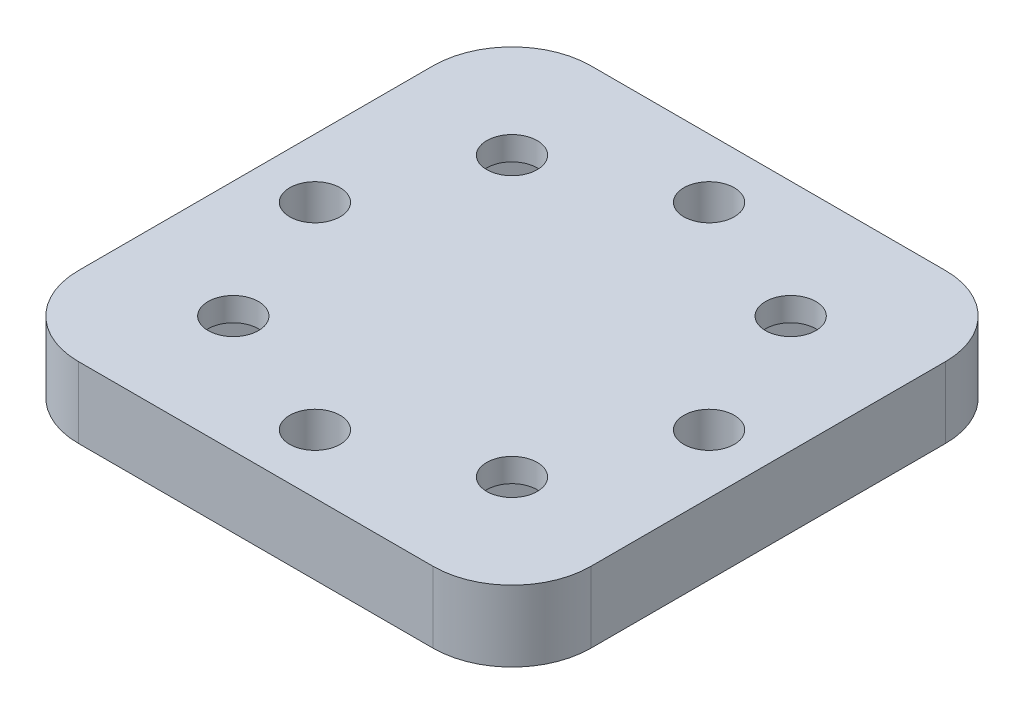
ISO-10303-21;
HEADER;
FILE_DESCRIPTION(('STEP AP214'),'2;1');
FILE_NAME('part.step','',(''),(''),'','','');
FILE_SCHEMA(('AUTOMOTIVE_DESIGN { 1 0 10303 214 1 1 1 1 }'));
ENDSEC;
DATA;
#1=APPLICATION_CONTEXT('core data for automotive mechanical design processes');
#2=APPLICATION_PROTOCOL_DEFINITION('international standard','automotive_design',2000,#1);
#3=PRODUCT_CONTEXT('',#1,'mechanical');
#4=PRODUCT('Part','Part','',(#3));
#5=PRODUCT_RELATED_PRODUCT_CATEGORY('part','',(#4));
#6=PRODUCT_DEFINITION_FORMATION('','',#4);
#7=PRODUCT_DEFINITION_CONTEXT('part definition',#1,'design');
#8=PRODUCT_DEFINITION('design','',#6,#7);
#9=PRODUCT_DEFINITION_SHAPE('','',#8);
#10=(LENGTH_UNIT() NAMED_UNIT(*) SI_UNIT(.MILLI.,.METRE.));
#11=(NAMED_UNIT(*) PLANE_ANGLE_UNIT() SI_UNIT($,.RADIAN.));
#12=(NAMED_UNIT(*) SI_UNIT($,.STERADIAN.) SOLID_ANGLE_UNIT());
#13=UNCERTAINTY_MEASURE_WITH_UNIT(LENGTH_MEASURE(1.E-05),#10,'distance_accuracy_value','');
#14=(GEOMETRIC_REPRESENTATION_CONTEXT(3) GLOBAL_UNCERTAINTY_ASSIGNED_CONTEXT((#13)) GLOBAL_UNIT_ASSIGNED_CONTEXT((#10,
#11,#12)) REPRESENTATION_CONTEXT('',''));
#15=CARTESIAN_POINT('',(0.,0.,0.));
#16=DIRECTION('',(0.,0.,1.));
#17=DIRECTION('',(1.,0.,0.));
#18=AXIS2_PLACEMENT_3D('',#15,#16,#17);
#19=CARTESIAN_POINT('',(-32.5,9.,-32.5));
#20=DIRECTION('',(1.,0.,0.));
#21=DIRECTION('',(0.,0.,-1.));
#22=AXIS2_PLACEMENT_3D('',#19,#20,#21);
#23=PLANE('',#22);
#24=DIRECTION('',(0.,0.,1.));
#25=VECTOR('',#24,1.);
#26=CARTESIAN_POINT('',(-32.5,0.,-32.5));
#27=LINE('',#26,#25);
#28=CARTESIAN_POINT('',(-32.5,0.,-22.5));
#29=VERTEX_POINT('',#28);
#30=CARTESIAN_POINT('',(-32.5,0.,22.5));
#31=VERTEX_POINT('',#30);
#32=EDGE_CURVE('E371',#29,#31,#27,.T.);
#33=ORIENTED_EDGE('',*,*,#32,.T.);
#34=DIRECTION('',(0.,-1.,0.));
#35=VECTOR('',#34,1.);
#36=CARTESIAN_POINT('',(-32.5,9.,22.5));
#37=LINE('',#36,#35);
#38=CARTESIAN_POINT('',(-32.5,9.,22.5));
#39=VERTEX_POINT('',#38);
#40=EDGE_CURVE('E429',#31,#39,#37,.F.);
#41=ORIENTED_EDGE('',*,*,#40,.T.);
#42=DIRECTION('',(0.,0.,1.));
#43=VECTOR('',#42,1.);
#44=CARTESIAN_POINT('',(-32.5,9.,-32.5));
#45=LINE('',#44,#43);
#46=CARTESIAN_POINT('',(-32.5,9.,-22.5));
#47=VERTEX_POINT('',#46);
#48=EDGE_CURVE('E372',#47,#39,#45,.T.);
#49=ORIENTED_EDGE('',*,*,#48,.F.);
#50=DIRECTION('',(0.,-1.,0.));
#51=VECTOR('',#50,1.);
#52=CARTESIAN_POINT('',(-32.5,9.,-22.5));
#53=LINE('',#52,#51);
#54=EDGE_CURVE('E426',#47,#29,#53,.T.);
#55=ORIENTED_EDGE('',*,*,#54,.T.);
#56=EDGE_LOOP('',(#33,#41,#49,#55));
#57=FACE_BOUND('',#56,.T.);
#58=ADVANCED_FACE('F35',(#57),#23,.F.);
#59=CARTESIAN_POINT('',(-32.5,9.,32.5));
#60=DIRECTION('',(0.,0.,-1.));
#61=DIRECTION('',(-1.,0.,0.));
#62=AXIS2_PLACEMENT_3D('',#59,#60,#61);
#63=PLANE('',#62);
#64=DIRECTION('',(1.,0.,0.));
#65=VECTOR('',#64,1.);
#66=CARTESIAN_POINT('',(-32.5,0.,32.5));
#67=LINE('',#66,#65);
#68=CARTESIAN_POINT('',(-22.5,0.,32.5));
#69=VERTEX_POINT('',#68);
#70=CARTESIAN_POINT('',(22.5,0.,32.5));
#71=VERTEX_POINT('',#70);
#72=EDGE_CURVE('E386',#69,#71,#67,.T.);
#73=ORIENTED_EDGE('',*,*,#72,.T.);
#74=DIRECTION('',(0.,-1.,0.));
#75=VECTOR('',#74,1.);
#76=CARTESIAN_POINT('',(22.5,9.,32.5));
#77=LINE('',#76,#75);
#78=CARTESIAN_POINT('',(22.5,9.,32.5));
#79=VERTEX_POINT('',#78);
#80=EDGE_CURVE('E417',#71,#79,#77,.F.);
#81=ORIENTED_EDGE('',*,*,#80,.T.);
#82=DIRECTION('',(1.,0.,0.));
#83=VECTOR('',#82,1.);
#84=CARTESIAN_POINT('',(-32.5,9.,32.5));
#85=LINE('',#84,#83);
#86=CARTESIAN_POINT('',(-22.5,9.,32.5));
#87=VERTEX_POINT('',#86);
#88=EDGE_CURVE('E375',#87,#79,#85,.T.);
#89=ORIENTED_EDGE('',*,*,#88,.F.);
#90=DIRECTION('',(0.,-1.,0.));
#91=VECTOR('',#90,1.);
#92=CARTESIAN_POINT('',(-22.5,9.,32.5));
#93=LINE('',#92,#91);
#94=EDGE_CURVE('E414',#87,#69,#93,.T.);
#95=ORIENTED_EDGE('',*,*,#94,.T.);
#96=EDGE_LOOP('',(#73,#81,#89,#95));
#97=FACE_BOUND('',#96,.T.);
#98=ADVANCED_FACE('F454',(#97),#63,.F.);
#99=CARTESIAN_POINT('',(32.5,9.,-32.5));
#100=DIRECTION('',(-1.,0.,0.));
#101=DIRECTION('',(0.,0.,1.));
#102=AXIS2_PLACEMENT_3D('',#99,#100,#101);
#103=PLANE('',#102);
#104=DIRECTION('',(0.,0.,-1.));
#105=VECTOR('',#104,1.);
#106=CARTESIAN_POINT('',(32.5,9.,-32.5));
#107=LINE('',#106,#105);
#108=CARTESIAN_POINT('',(32.5,9.,22.5));
#109=VERTEX_POINT('',#108);
#110=CARTESIAN_POINT('',(32.5,9.,-22.5));
#111=VERTEX_POINT('',#110);
#112=EDGE_CURVE('E379',#109,#111,#107,.T.);
#113=ORIENTED_EDGE('',*,*,#112,.F.);
#114=DIRECTION('',(0.,-1.,0.));
#115=VECTOR('',#114,1.);
#116=CARTESIAN_POINT('',(32.5,9.,22.5));
#117=LINE('',#116,#115);
#118=CARTESIAN_POINT('',(32.5,0.,22.5));
#119=VERTEX_POINT('',#118);
#120=EDGE_CURVE('E403',#109,#119,#117,.T.);
#121=ORIENTED_EDGE('',*,*,#120,.T.);
#122=DIRECTION('',(0.,0.,-1.));
#123=VECTOR('',#122,1.);
#124=CARTESIAN_POINT('',(32.5,0.,-32.5));
#125=LINE('',#124,#123);
#126=CARTESIAN_POINT('',(32.5,0.,-22.5));
#127=VERTEX_POINT('',#126);
#128=EDGE_CURVE('E389',#119,#127,#125,.T.);
#129=ORIENTED_EDGE('',*,*,#128,.T.);
#130=DIRECTION('',(0.,-1.,0.));
#131=VECTOR('',#130,1.);
#132=CARTESIAN_POINT('',(32.5,9.,-22.5));
#133=LINE('',#132,#131);
#134=EDGE_CURVE('E383',#127,#111,#133,.F.);
#135=ORIENTED_EDGE('',*,*,#134,.T.);
#136=EDGE_LOOP('',(#113,#121,#129,#135));
#137=FACE_BOUND('',#136,.T.);
#138=ADVANCED_FACE('F462',(#137),#103,.F.);
#139=CARTESIAN_POINT('',(-32.5,9.,-32.5));
#140=DIRECTION('',(0.,0.,1.));
#141=DIRECTION('',(1.,0.,0.));
#142=AXIS2_PLACEMENT_3D('',#139,#140,#141);
#143=PLANE('',#142);
#144=DIRECTION('',(-1.,0.,0.));
#145=VECTOR('',#144,1.);
#146=CARTESIAN_POINT('',(-32.5,0.,-32.5));
#147=LINE('',#146,#145);
#148=CARTESIAN_POINT('',(22.5,0.,-32.5));
#149=VERTEX_POINT('',#148);
#150=CARTESIAN_POINT('',(-22.5,0.,-32.5));
#151=VERTEX_POINT('',#150);
#152=EDGE_CURVE('E376',#149,#151,#147,.T.);
#153=ORIENTED_EDGE('',*,*,#152,.T.);
#154=DIRECTION('',(0.,-1.,0.));
#155=VECTOR('',#154,1.);
#156=CARTESIAN_POINT('',(-22.5,9.,-32.5));
#157=LINE('',#156,#155);
#158=CARTESIAN_POINT('',(-22.5,9.,-32.5));
#159=VERTEX_POINT('',#158);
#160=EDGE_CURVE('E12',#151,#159,#157,.F.);
#161=ORIENTED_EDGE('',*,*,#160,.T.);
#162=DIRECTION('',(-1.,0.,0.));
#163=VECTOR('',#162,1.);
#164=CARTESIAN_POINT('',(-32.5,9.,-32.5));
#165=LINE('',#164,#163);
#166=CARTESIAN_POINT('',(22.5,9.,-32.5));
#167=VERTEX_POINT('',#166);
#168=EDGE_CURVE('E381',#167,#159,#165,.T.);
#169=ORIENTED_EDGE('',*,*,#168,.F.);
#170=DIRECTION('',(0.,-1.,0.));
#171=VECTOR('',#170,1.);
#172=CARTESIAN_POINT('',(22.5,9.,-32.5));
#173=LINE('',#172,#171);
#174=EDGE_CURVE('E43',#167,#149,#173,.T.);
#175=ORIENTED_EDGE('',*,*,#174,.T.);
#176=EDGE_LOOP('',(#153,#161,#169,#175));
#177=FACE_BOUND('',#176,.T.);
#178=ADVANCED_FACE('F433',(#177),#143,.F.);
#179=CARTESIAN_POINT('',(0.,9.,0.));
#180=DIRECTION('',(0.,1.,0.));
#181=DIRECTION('',(0.,0.,1.));
#182=AXIS2_PLACEMENT_3D('',#179,#180,#181);
#183=PLANE('',#182);
#184=CARTESIAN_POINT('',(0.,9.,25.));
#185=DIRECTION('',(0.,1.,0.));
#186=DIRECTION('',(0.,0.,1.));
#187=AXIS2_PLACEMENT_3D('',#184,#185,#186);
#188=CIRCLE('',#187,3.2);
#189=CARTESIAN_POINT('',(0.,9.,28.2));
#190=VERTEX_POINT('',#189);
#191=EDGE_CURVE('E348',#190,#190,#188,.T.);
#192=ORIENTED_EDGE('',*,*,#191,.F.);
#193=EDGE_LOOP('',(#192));
#194=FACE_BOUND('',#193,.T.);
#195=CARTESIAN_POINT('',(-25.,9.,0.));
#196=DIRECTION('',(0.,1.,0.));
#197=DIRECTION('',(0.,0.,1.));
#198=AXIS2_PLACEMENT_3D('',#195,#196,#197);
#199=CIRCLE('',#198,3.2);
#200=CARTESIAN_POINT('',(-25.,9.,3.20000000000001));
#201=VERTEX_POINT('',#200);
#202=EDGE_CURVE('E342',#201,#201,#199,.T.);
#203=ORIENTED_EDGE('',*,*,#202,.F.);
#204=EDGE_LOOP('',(#203));
#205=FACE_BOUND('',#204,.T.);
#206=CARTESIAN_POINT('',(0.,9.,-25.));
#207=DIRECTION('',(0.,1.,0.));
#208=DIRECTION('',(0.,0.,1.));
#209=AXIS2_PLACEMENT_3D('',#206,#207,#208);
#210=CIRCLE('',#209,3.2);
#211=CARTESIAN_POINT('',(0.,9.,-21.8));
#212=VERTEX_POINT('',#211);
#213=EDGE_CURVE('E335',#212,#212,#210,.T.);
#214=ORIENTED_EDGE('',*,*,#213,.F.);
#215=EDGE_LOOP('',(#214));
#216=FACE_BOUND('',#215,.T.);
#217=CARTESIAN_POINT('',(25.,9.,0.));
#218=DIRECTION('',(0.,1.,0.));
#219=DIRECTION('',(0.,0.,1.));
#220=AXIS2_PLACEMENT_3D('',#217,#218,#219);
#221=CIRCLE('',#220,3.2);
#222=CARTESIAN_POINT('',(25.,9.,3.19999999999999));
#223=VERTEX_POINT('',#222);
#224=EDGE_CURVE('E343',#223,#223,#221,.T.);
#225=ORIENTED_EDGE('',*,*,#224,.F.);
#226=EDGE_LOOP('',(#225));
#227=FACE_BOUND('',#226,.T.);
#228=CARTESIAN_POINT('',(17.6776695296637,9.,17.6776695296636));
#229=DIRECTION('',(0.,1.,0.));
#230=DIRECTION('',(0.,0.,1.));
#231=AXIS2_PLACEMENT_3D('',#228,#229,#230);
#232=CIRCLE('',#231,3.2);
#233=CARTESIAN_POINT('',(17.6776695296637,9.,20.8776695296636));
#234=VERTEX_POINT('',#233);
#235=EDGE_CURVE('E363',#234,#234,#232,.T.);
#236=ORIENTED_EDGE('',*,*,#235,.F.);
#237=EDGE_LOOP('',(#236));
#238=FACE_BOUND('',#237,.T.);
#239=CARTESIAN_POINT('',(-17.6776695296637,9.,17.6776695296637));
#240=DIRECTION('',(0.,1.,0.));
#241=DIRECTION('',(0.,0.,1.));
#242=AXIS2_PLACEMENT_3D('',#239,#240,#241);
#243=CIRCLE('',#242,3.2);
#244=CARTESIAN_POINT('',(-17.6776695296637,9.,20.8776695296637));
#245=VERTEX_POINT('',#244);
#246=EDGE_CURVE('E360',#245,#245,#243,.T.);
#247=ORIENTED_EDGE('',*,*,#246,.F.);
#248=EDGE_LOOP('',(#247));
#249=FACE_BOUND('',#248,.T.);
#250=CARTESIAN_POINT('',(17.6776695296637,9.,-17.6776695296637));
#251=DIRECTION('',(0.,1.,0.));
#252=DIRECTION('',(0.,0.,1.));
#253=AXIS2_PLACEMENT_3D('',#250,#251,#252);
#254=CIRCLE('',#253,3.2);
#255=CARTESIAN_POINT('',(17.6776695296637,9.,-14.4776695296637));
#256=VERTEX_POINT('',#255);
#257=EDGE_CURVE('E355',#256,#256,#254,.T.);
#258=ORIENTED_EDGE('',*,*,#257,.F.);
#259=EDGE_LOOP('',(#258));
#260=FACE_BOUND('',#259,.T.);
#261=CARTESIAN_POINT('',(-17.6776695296637,9.,-17.6776695296636));
#262=DIRECTION('',(0.,1.,0.));
#263=DIRECTION('',(0.,0.,1.));
#264=AXIS2_PLACEMENT_3D('',#261,#262,#263);
#265=CIRCLE('',#264,3.2);
#266=CARTESIAN_POINT('',(-17.6776695296637,9.,-14.4776695296637));
#267=VERTEX_POINT('',#266);
#268=EDGE_CURVE('E368',#267,#267,#265,.T.);
#269=ORIENTED_EDGE('',*,*,#268,.F.);
#270=EDGE_LOOP('',(#269));
#271=FACE_BOUND('',#270,.T.);
#272=ORIENTED_EDGE('',*,*,#88,.T.);
#273=CARTESIAN_POINT('',(22.5,9.,22.5));
#274=DIRECTION('',(0.,1.,0.));
#275=DIRECTION('',(0.,0.,1.));
#276=AXIS2_PLACEMENT_3D('',#273,#274,#275);
#277=CIRCLE('',#276,10.);
#278=EDGE_CURVE('E424',#79,#109,#277,.T.);
#279=ORIENTED_EDGE('',*,*,#278,.T.);
#280=ORIENTED_EDGE('',*,*,#112,.T.);
#281=CARTESIAN_POINT('',(22.5,9.,-22.5));
#282=DIRECTION('',(0.,1.,0.));
#283=DIRECTION('',(0.,0.,1.));
#284=AXIS2_PLACEMENT_3D('',#281,#282,#283);
#285=CIRCLE('',#284,10.);
#286=EDGE_CURVE('E55',#111,#167,#285,.T.);
#287=ORIENTED_EDGE('',*,*,#286,.T.);
#288=ORIENTED_EDGE('',*,*,#168,.T.);
#289=CARTESIAN_POINT('',(-22.5,9.,-22.5));
#290=DIRECTION('',(0.,1.,0.));
#291=DIRECTION('',(0.,0.,1.));
#292=AXIS2_PLACEMENT_3D('',#289,#290,#291);
#293=CIRCLE('',#292,10.);
#294=EDGE_CURVE('E420',#159,#47,#293,.T.);
#295=ORIENTED_EDGE('',*,*,#294,.T.);
#296=ORIENTED_EDGE('',*,*,#48,.T.);
#297=CARTESIAN_POINT('',(-22.5,9.,22.5));
#298=DIRECTION('',(0.,1.,0.));
#299=DIRECTION('',(0.,0.,1.));
#300=AXIS2_PLACEMENT_3D('',#297,#298,#299);
#301=CIRCLE('',#300,10.);
#302=EDGE_CURVE('E422',#39,#87,#301,.T.);
#303=ORIENTED_EDGE('',*,*,#302,.T.);
#304=EDGE_LOOP('',(#272,#279,#280,#287,#288,#295,#296,#303));
#305=FACE_BOUND('',#304,.T.);
#306=ADVANCED_FACE('F447',(#194,#205,#216,#227,#238,#249,#260,#271,#305),#183,.T.);
#307=CARTESIAN_POINT('',(0.,0.,0.));
#308=DIRECTION('',(0.,1.,0.));
#309=DIRECTION('',(0.,0.,1.));
#310=AXIS2_PLACEMENT_3D('',#307,#308,#309);
#311=PLANE('',#310);
#312=DIRECTION('',(0.707106781186549,0.,0.707106781186546));
#313=VECTOR('',#312,1.);
#314=CARTESIAN_POINT('',(17.6776695296637,0.,10.3237590053236));
#315=LINE('',#314,#313);
#316=CARTESIAN_POINT('',(17.6776695296637,0.,10.3237590053236));
#317=VERTEX_POINT('',#316);
#318=CARTESIAN_POINT('',(25.0315800540038,0.,17.6776695296636));
#319=VERTEX_POINT('',#318);
#320=EDGE_CURVE('E221',#317,#319,#315,.T.);
#321=ORIENTED_EDGE('',*,*,#320,.F.);
#322=DIRECTION('',(0.707106781186552,0.,-0.707106781186543));
#323=VECTOR('',#322,1.);
#324=CARTESIAN_POINT('',(10.3237590053236,0.,17.6776695296636));
#325=LINE('',#324,#323);
#326=CARTESIAN_POINT('',(10.3237590053236,0.,17.6776695296636));
#327=VERTEX_POINT('',#326);
#328=EDGE_CURVE('E212',#327,#317,#325,.T.);
#329=ORIENTED_EDGE('',*,*,#328,.F.);
#330=DIRECTION('',(-0.707106781186549,0.,-0.707106781186546));
#331=VECTOR('',#330,1.);
#332=CARTESIAN_POINT('',(10.3237590053236,0.,17.6776695296636));
#333=LINE('',#332,#331);
#334=CARTESIAN_POINT('',(17.6776695296637,0.,25.0315800540037));
#335=VERTEX_POINT('',#334);
#336=EDGE_CURVE('E225',#335,#327,#333,.T.);
#337=ORIENTED_EDGE('',*,*,#336,.F.);
#338=DIRECTION('',(-0.707106781186546,0.,0.707106781186549));
#339=VECTOR('',#338,1.);
#340=CARTESIAN_POINT('',(17.6776695296637,0.,25.0315800540037));
#341=LINE('',#340,#339);
#342=EDGE_CURVE('E219',#319,#335,#341,.T.);
#343=ORIENTED_EDGE('',*,*,#342,.F.);
#344=EDGE_LOOP('',(#321,#329,#337,#343));
#345=FACE_BOUND('',#344,.T.);
#346=DIRECTION('',(0.707106781186547,0.,0.707106781186547));
#347=VECTOR('',#346,1.);
#348=CARTESIAN_POINT('',(17.6776695296637,0.,-25.0315800540038));
#349=LINE('',#348,#347);
#350=CARTESIAN_POINT('',(17.6776695296637,0.,-25.0315800540038));
#351=VERTEX_POINT('',#350);
#352=CARTESIAN_POINT('',(25.0315800540038,0.,-17.6776695296637));
#353=VERTEX_POINT('',#352);
#354=EDGE_CURVE('E240',#351,#353,#349,.T.);
#355=ORIENTED_EDGE('',*,*,#354,.F.);
#356=DIRECTION('',(0.707106781186544,0.,-0.707106781186551));
#357=VECTOR('',#356,1.);
#358=CARTESIAN_POINT('',(10.3237590053236,0.,-17.6776695296636));
#359=LINE('',#358,#357);
#360=CARTESIAN_POINT('',(10.3237590053236,0.,-17.6776695296636));
#361=VERTEX_POINT('',#360);
#362=EDGE_CURVE('E243',#361,#351,#359,.T.);
#363=ORIENTED_EDGE('',*,*,#362,.F.);
#364=DIRECTION('',(-0.707106781186546,0.,-0.707106781186549));
#365=VECTOR('',#364,1.);
#366=CARTESIAN_POINT('',(10.3237590053236,0.,-17.6776695296636));
#367=LINE('',#366,#365);
#368=CARTESIAN_POINT('',(17.6776695296637,0.,-10.3237590053236));
#369=VERTEX_POINT('',#368);
#370=EDGE_CURVE('E246',#369,#361,#367,.T.);
#371=ORIENTED_EDGE('',*,*,#370,.F.);
#372=DIRECTION('',(-0.707106781186547,0.,0.707106781186547));
#373=VECTOR('',#372,1.);
#374=CARTESIAN_POINT('',(17.6776695296637,0.,-10.3237590053236));
#375=LINE('',#374,#373);
#376=EDGE_CURVE('E237',#353,#369,#375,.T.);
#377=ORIENTED_EDGE('',*,*,#376,.F.);
#378=EDGE_LOOP('',(#355,#363,#371,#377));
#379=FACE_BOUND('',#378,.T.);
#380=DIRECTION('',(0.707106781186547,0.,0.707106781186548));
#381=VECTOR('',#380,1.);
#382=CARTESIAN_POINT('',(-17.6776695296637,0.,-25.0315800540038));
#383=LINE('',#382,#381);
#384=CARTESIAN_POINT('',(-17.6776695296637,0.,-25.0315800540038));
#385=VERTEX_POINT('',#384);
#386=CARTESIAN_POINT('',(-10.3237590053236,0.,-17.6776695296637));
#387=VERTEX_POINT('',#386);
#388=EDGE_CURVE('E273',#385,#387,#383,.T.);
#389=ORIENTED_EDGE('',*,*,#388,.F.);
#390=DIRECTION('',(0.707106781186553,0.,-0.707106781186542));
#391=VECTOR('',#390,1.);
#392=CARTESIAN_POINT('',(-25.0315800540038,0.,-17.6776695296638));
#393=LINE('',#392,#391);
#394=CARTESIAN_POINT('',(-25.0315800540038,0.,-17.6776695296638));
#395=VERTEX_POINT('',#394);
#396=EDGE_CURVE('E276',#395,#385,#393,.T.);
#397=ORIENTED_EDGE('',*,*,#396,.F.);
#398=DIRECTION('',(-0.707106781186547,0.,-0.707106781186547));
#399=VECTOR('',#398,1.);
#400=CARTESIAN_POINT('',(-25.0315800540038,0.,-17.6776695296638));
#401=LINE('',#400,#399);
#402=CARTESIAN_POINT('',(-17.6776695296637,0.,-10.3237590053236));
#403=VERTEX_POINT('',#402);
#404=EDGE_CURVE('E279',#403,#395,#401,.T.);
#405=ORIENTED_EDGE('',*,*,#404,.F.);
#406=DIRECTION('',(-0.707106781186547,0.,0.707106781186549));
#407=VECTOR('',#406,1.);
#408=CARTESIAN_POINT('',(-17.6776695296637,0.,-10.3237590053236));
#409=LINE('',#408,#407);
#410=EDGE_CURVE('E270',#387,#403,#409,.T.);
#411=ORIENTED_EDGE('',*,*,#410,.F.);
#412=EDGE_LOOP('',(#389,#397,#405,#411));
#413=FACE_BOUND('',#412,.T.);
#414=DIRECTION('',(0.707106781186546,0.,0.707106781186549));
#415=VECTOR('',#414,1.);
#416=CARTESIAN_POINT('',(-17.6776695296637,0.,10.3237590053236));
#417=LINE('',#416,#415);
#418=CARTESIAN_POINT('',(-17.6776695296637,0.,10.3237590053236));
#419=VERTEX_POINT('',#418);
#420=CARTESIAN_POINT('',(-10.3237590053236,0.,17.6776695296636));
#421=VERTEX_POINT('',#420);
#422=EDGE_CURVE('E304',#419,#421,#417,.T.);
#423=ORIENTED_EDGE('',*,*,#422,.F.);
#424=DIRECTION('',(0.707106781186549,0.,-0.707106781186546));
#425=VECTOR('',#424,1.);
#426=CARTESIAN_POINT('',(-25.0315800540038,0.,17.6776695296636));
#427=LINE('',#426,#425);
#428=CARTESIAN_POINT('',(-25.0315800540038,0.,17.6776695296636));
#429=VERTEX_POINT('',#428);
#430=EDGE_CURVE('E307',#429,#419,#427,.T.);
#431=ORIENTED_EDGE('',*,*,#430,.F.);
#432=DIRECTION('',(-0.707106781186546,0.,-0.707106781186549));
#433=VECTOR('',#432,1.);
#434=CARTESIAN_POINT('',(-25.0315800540038,0.,17.6776695296636));
#435=LINE('',#434,#433);
#436=CARTESIAN_POINT('',(-17.6776695296637,0.,25.0315800540038));
#437=VERTEX_POINT('',#436);
#438=EDGE_CURVE('E310',#437,#429,#435,.T.);
#439=ORIENTED_EDGE('',*,*,#438,.F.);
#440=DIRECTION('',(-0.707106781186543,0.,0.707106781186552));
#441=VECTOR('',#440,1.);
#442=CARTESIAN_POINT('',(-17.6776695296637,0.,25.0315800540038));
#443=LINE('',#442,#441);
#444=EDGE_CURVE('E301',#421,#437,#443,.T.);
#445=ORIENTED_EDGE('',*,*,#444,.F.);
#446=EDGE_LOOP('',(#423,#431,#439,#445));
#447=FACE_BOUND('',#446,.T.);
#448=CARTESIAN_POINT('',(0.,0.,25.));
#449=DIRECTION('',(0.,1.,0.));
#450=DIRECTION('',(0.,0.,1.));
#451=AXIS2_PLACEMENT_3D('',#448,#449,#450);
#452=CIRCLE('',#451,3.2);
#453=CARTESIAN_POINT('',(0.,0.,28.2));
#454=VERTEX_POINT('',#453);
#455=EDGE_CURVE('E351',#454,#454,#452,.F.);
#456=ORIENTED_EDGE('',*,*,#455,.F.);
#457=EDGE_LOOP('',(#456));
#458=FACE_BOUND('',#457,.T.);
#459=CARTESIAN_POINT('',(-25.,0.,0.));
#460=DIRECTION('',(0.,1.,0.));
#461=DIRECTION('',(0.,0.,1.));
#462=AXIS2_PLACEMENT_3D('',#459,#460,#461);
#463=CIRCLE('',#462,3.2);
#464=CARTESIAN_POINT('',(-25.,0.,3.20000000000001));
#465=VERTEX_POINT('',#464);
#466=EDGE_CURVE('E352',#465,#465,#463,.F.);
#467=ORIENTED_EDGE('',*,*,#466,.F.);
#468=EDGE_LOOP('',(#467));
#469=FACE_BOUND('',#468,.T.);
#470=CARTESIAN_POINT('',(0.,0.,-25.));
#471=DIRECTION('',(0.,1.,0.));
#472=DIRECTION('',(0.,0.,1.));
#473=AXIS2_PLACEMENT_3D('',#470,#471,#472);
#474=CIRCLE('',#473,3.2);
#475=CARTESIAN_POINT('',(0.,0.,-21.8));
#476=VERTEX_POINT('',#475);
#477=EDGE_CURVE('E338',#476,#476,#474,.F.);
#478=ORIENTED_EDGE('',*,*,#477,.F.);
#479=EDGE_LOOP('',(#478));
#480=FACE_BOUND('',#479,.T.);
#481=CARTESIAN_POINT('',(25.,0.,0.));
#482=DIRECTION('',(0.,1.,0.));
#483=DIRECTION('',(0.,0.,1.));
#484=AXIS2_PLACEMENT_3D('',#481,#482,#483);
#485=CIRCLE('',#484,3.2);
#486=CARTESIAN_POINT('',(25.,0.,3.19999999999999));
#487=VERTEX_POINT('',#486);
#488=EDGE_CURVE('E339',#487,#487,#485,.F.);
#489=ORIENTED_EDGE('',*,*,#488,.F.);
#490=EDGE_LOOP('',(#489));
#491=FACE_BOUND('',#490,.T.);
#492=ORIENTED_EDGE('',*,*,#128,.F.);
#493=CARTESIAN_POINT('',(22.5,0.,22.5));
#494=DIRECTION('',(0.,1.,0.));
#495=DIRECTION('',(0.,0.,1.));
#496=AXIS2_PLACEMENT_3D('',#493,#494,#495);
#497=CIRCLE('',#496,10.);
#498=EDGE_CURVE('E412',#119,#71,#497,.F.);
#499=ORIENTED_EDGE('',*,*,#498,.T.);
#500=ORIENTED_EDGE('',*,*,#72,.F.);
#501=CARTESIAN_POINT('',(-22.5,0.,22.5));
#502=DIRECTION('',(0.,1.,0.));
#503=DIRECTION('',(0.,0.,1.));
#504=AXIS2_PLACEMENT_3D('',#501,#502,#503);
#505=CIRCLE('',#504,10.);
#506=EDGE_CURVE('E410',#69,#31,#505,.F.);
#507=ORIENTED_EDGE('',*,*,#506,.T.);
#508=ORIENTED_EDGE('',*,*,#32,.F.);
#509=CARTESIAN_POINT('',(-22.5,0.,-22.5));
#510=DIRECTION('',(0.,1.,0.));
#511=DIRECTION('',(0.,0.,1.));
#512=AXIS2_PLACEMENT_3D('',#509,#510,#511);
#513=CIRCLE('',#512,10.);
#514=EDGE_CURVE('E408',#29,#151,#513,.F.);
#515=ORIENTED_EDGE('',*,*,#514,.T.);
#516=ORIENTED_EDGE('',*,*,#152,.F.);
#517=CARTESIAN_POINT('',(22.5,0.,-22.5));
#518=DIRECTION('',(0.,1.,0.));
#519=DIRECTION('',(0.,0.,1.));
#520=AXIS2_PLACEMENT_3D('',#517,#518,#519);
#521=CIRCLE('',#520,10.);
#522=EDGE_CURVE('E406',#149,#127,#521,.F.);
#523=ORIENTED_EDGE('',*,*,#522,.T.);
#524=EDGE_LOOP('',(#492,#499,#500,#507,#508,#515,#516,#523));
#525=FACE_BOUND('',#524,.T.);
#526=ADVANCED_FACE('F437',(#345,#379,#413,#447,#458,#469,#480,#491,#525),#311,.F.);
#527=CARTESIAN_POINT('',(-17.6776695296637,-9.05096679918782,-17.6776695296636));
#528=DIRECTION('',(0.,1.,0.));
#529=DIRECTION('',(0.,0.,1.));
#530=AXIS2_PLACEMENT_3D('',#527,#528,#529);
#531=CYLINDRICAL_SURFACE('',#530,3.2);
#532=CARTESIAN_POINT('',(-17.6776695296637,6.,-17.6776695296636));
#533=DIRECTION('',(0.,1.,0.));
#534=DIRECTION('',(0.,0.,1.));
#535=AXIS2_PLACEMENT_3D('',#532,#533,#534);
#536=CIRCLE('',#535,3.2);
#537=CARTESIAN_POINT('',(-17.6776695296637,6.,-14.4776695296637));
#538=VERTEX_POINT('',#537);
#539=EDGE_CURVE('E313',#538,#538,#536,.F.);
#540=ORIENTED_EDGE('',*,*,#539,.T.);
#541=EDGE_LOOP('',(#540));
#542=FACE_BOUND('',#541,.T.);
#543=ORIENTED_EDGE('',*,*,#268,.T.);
#544=EDGE_LOOP('',(#543));
#545=FACE_BOUND('',#544,.T.);
#546=ADVANCED_FACE('F738',(#542,#545),#531,.F.);
#547=CARTESIAN_POINT('',(17.6776695296637,-9.05096679918782,-17.6776695296637));
#548=DIRECTION('',(0.,1.,0.));
#549=DIRECTION('',(0.,0.,1.));
#550=AXIS2_PLACEMENT_3D('',#547,#548,#549);
#551=CYLINDRICAL_SURFACE('',#550,3.2);
#552=CARTESIAN_POINT('',(17.6776695296637,6.,-17.6776695296637));
#553=DIRECTION('',(0.,1.,0.));
#554=DIRECTION('',(0.,0.,1.));
#555=AXIS2_PLACEMENT_3D('',#552,#553,#554);
#556=CIRCLE('',#555,3.2);
#557=CARTESIAN_POINT('',(17.6776695296637,6.,-14.4776695296637));
#558=VERTEX_POINT('',#557);
#559=EDGE_CURVE('E397',#558,#558,#556,.F.);
#560=ORIENTED_EDGE('',*,*,#559,.T.);
#561=EDGE_LOOP('',(#560));
#562=FACE_BOUND('',#561,.T.);
#563=ORIENTED_EDGE('',*,*,#257,.T.);
#564=EDGE_LOOP('',(#563));
#565=FACE_BOUND('',#564,.T.);
#566=ADVANCED_FACE('F729',(#562,#565),#551,.F.);
#567=CARTESIAN_POINT('',(-17.6776695296637,-9.05096679918782,17.6776695296637));
#568=DIRECTION('',(0.,1.,0.));
#569=DIRECTION('',(0.,0.,1.));
#570=AXIS2_PLACEMENT_3D('',#567,#568,#569);
#571=CYLINDRICAL_SURFACE('',#570,3.2);
#572=CARTESIAN_POINT('',(-17.6776695296637,6.,17.6776695296637));
#573=DIRECTION('',(0.,1.,0.));
#574=DIRECTION('',(0.,0.,1.));
#575=AXIS2_PLACEMENT_3D('',#572,#573,#574);
#576=CIRCLE('',#575,3.2);
#577=CARTESIAN_POINT('',(-17.6776695296637,6.,20.8776695296637));
#578=VERTEX_POINT('',#577);
#579=EDGE_CURVE('E334',#578,#578,#576,.F.);
#580=ORIENTED_EDGE('',*,*,#579,.T.);
#581=EDGE_LOOP('',(#580));
#582=FACE_BOUND('',#581,.T.);
#583=ORIENTED_EDGE('',*,*,#246,.T.);
#584=EDGE_LOOP('',(#583));
#585=FACE_BOUND('',#584,.T.);
#586=ADVANCED_FACE('F720',(#582,#585),#571,.F.);
#587=CARTESIAN_POINT('',(17.6776695296637,-9.05096679918782,17.6776695296636));
#588=DIRECTION('',(0.,1.,0.));
#589=DIRECTION('',(0.,0.,1.));
#590=AXIS2_PLACEMENT_3D('',#587,#588,#589);
#591=CYLINDRICAL_SURFACE('',#590,3.2);
#592=CARTESIAN_POINT('',(17.6776695296637,6.,17.6776695296636));
#593=DIRECTION('',(0.,1.,0.));
#594=DIRECTION('',(0.,0.,1.));
#595=AXIS2_PLACEMENT_3D('',#592,#593,#594);
#596=CIRCLE('',#595,3.2);
#597=CARTESIAN_POINT('',(17.6776695296637,6.,20.8776695296636));
#598=VERTEX_POINT('',#597);
#599=EDGE_CURVE('E236',#598,#598,#596,.F.);
#600=ORIENTED_EDGE('',*,*,#599,.T.);
#601=EDGE_LOOP('',(#600));
#602=FACE_BOUND('',#601,.T.);
#603=ORIENTED_EDGE('',*,*,#235,.T.);
#604=EDGE_LOOP('',(#603));
#605=FACE_BOUND('',#604,.T.);
#606=ADVANCED_FACE('F712',(#602,#605),#591,.F.);
#607=CARTESIAN_POINT('',(25.,-9.05096679918782,0.));
#608=DIRECTION('',(0.,1.,0.));
#609=DIRECTION('',(0.,0.,1.));
#610=AXIS2_PLACEMENT_3D('',#607,#608,#609);
#611=CYLINDRICAL_SURFACE('',#610,3.2);
#612=ORIENTED_EDGE('',*,*,#488,.T.);
#613=EDGE_LOOP('',(#612));
#614=FACE_BOUND('',#613,.T.);
#615=ORIENTED_EDGE('',*,*,#224,.T.);
#616=EDGE_LOOP('',(#615));
#617=FACE_BOUND('',#616,.T.);
#618=ADVANCED_FACE('F703',(#614,#617),#611,.F.);
#619=CARTESIAN_POINT('',(0.,-9.05096679918782,-25.));
#620=DIRECTION('',(0.,1.,0.));
#621=DIRECTION('',(0.,0.,1.));
#622=AXIS2_PLACEMENT_3D('',#619,#620,#621);
#623=CYLINDRICAL_SURFACE('',#622,3.2);
#624=ORIENTED_EDGE('',*,*,#477,.T.);
#625=EDGE_LOOP('',(#624));
#626=FACE_BOUND('',#625,.T.);
#627=ORIENTED_EDGE('',*,*,#213,.T.);
#628=EDGE_LOOP('',(#627));
#629=FACE_BOUND('',#628,.T.);
#630=ADVANCED_FACE('F694',(#626,#629),#623,.F.);
#631=CARTESIAN_POINT('',(-25.,-9.05096679918782,0.));
#632=DIRECTION('',(0.,1.,0.));
#633=DIRECTION('',(0.,0.,1.));
#634=AXIS2_PLACEMENT_3D('',#631,#632,#633);
#635=CYLINDRICAL_SURFACE('',#634,3.2);
#636=ORIENTED_EDGE('',*,*,#466,.T.);
#637=EDGE_LOOP('',(#636));
#638=FACE_BOUND('',#637,.T.);
#639=ORIENTED_EDGE('',*,*,#202,.T.);
#640=EDGE_LOOP('',(#639));
#641=FACE_BOUND('',#640,.T.);
#642=ADVANCED_FACE('F684',(#638,#641),#635,.F.);
#643=CARTESIAN_POINT('',(0.,-9.05096679918782,25.));
#644=DIRECTION('',(0.,1.,0.));
#645=DIRECTION('',(0.,0.,1.));
#646=AXIS2_PLACEMENT_3D('',#643,#644,#645);
#647=CYLINDRICAL_SURFACE('',#646,3.2);
#648=ORIENTED_EDGE('',*,*,#455,.T.);
#649=EDGE_LOOP('',(#648));
#650=FACE_BOUND('',#649,.T.);
#651=ORIENTED_EDGE('',*,*,#191,.T.);
#652=EDGE_LOOP('',(#651));
#653=FACE_BOUND('',#652,.T.);
#654=ADVANCED_FACE('F674',(#650,#653),#647,.F.);
#655=CARTESIAN_POINT('',(0.,6.,0.));
#656=DIRECTION('',(0.,1.,0.));
#657=DIRECTION('',(0.,0.,1.));
#658=AXIS2_PLACEMENT_3D('',#655,#656,#657);
#659=PLANE('',#658);
#660=DIRECTION('',(-0.707106781186546,0.,-0.707106781186549));
#661=VECTOR('',#660,1.);
#662=CARTESIAN_POINT('',(-25.0315800540038,6.,17.6776695296636));
#663=LINE('',#662,#661);
#664=CARTESIAN_POINT('',(-17.6776695296637,6.,25.0315800540038));
#665=VERTEX_POINT('',#664);
#666=CARTESIAN_POINT('',(-25.0315800540038,6.,17.6776695296636));
#667=VERTEX_POINT('',#666);
#668=EDGE_CURVE('E317',#665,#667,#663,.T.);
#669=ORIENTED_EDGE('',*,*,#668,.T.);
#670=DIRECTION('',(0.707106781186549,0.,-0.707106781186546));
#671=VECTOR('',#670,1.);
#672=CARTESIAN_POINT('',(-25.0315800540038,6.,17.6776695296636));
#673=LINE('',#672,#671);
#674=CARTESIAN_POINT('',(-17.6776695296637,6.,10.3237590053236));
#675=VERTEX_POINT('',#674);
#676=EDGE_CURVE('E303',#667,#675,#673,.T.);
#677=ORIENTED_EDGE('',*,*,#676,.T.);
#678=DIRECTION('',(0.707106781186546,0.,0.707106781186549));
#679=VECTOR('',#678,1.);
#680=CARTESIAN_POINT('',(-17.6776695296637,6.,10.3237590053236));
#681=LINE('',#680,#679);
#682=CARTESIAN_POINT('',(-10.3237590053236,6.,17.6776695296636));
#683=VERTEX_POINT('',#682);
#684=EDGE_CURVE('E326',#675,#683,#681,.T.);
#685=ORIENTED_EDGE('',*,*,#684,.T.);
#686=DIRECTION('',(-0.707106781186543,0.,0.707106781186552));
#687=VECTOR('',#686,1.);
#688=CARTESIAN_POINT('',(-17.6776695296637,6.,25.0315800540038));
#689=LINE('',#688,#687);
#690=EDGE_CURVE('E322',#683,#665,#689,.T.);
#691=ORIENTED_EDGE('',*,*,#690,.T.);
#692=EDGE_LOOP('',(#669,#677,#685,#691));
#693=FACE_BOUND('',#692,.T.);
#694=ORIENTED_EDGE('',*,*,#579,.F.);
#695=EDGE_LOOP('',(#694));
#696=FACE_BOUND('',#695,.T.);
#697=ADVANCED_FACE('F665',(#693,#696),#659,.F.);
#698=CARTESIAN_POINT('',(-25.0315800540038,29.8,17.6776695296636));
#699=DIRECTION('',(-0.707106781186546,0.,-0.707106781186549));
#700=DIRECTION('',(-0.707106781186549,0.,0.707106781186546));
#701=AXIS2_PLACEMENT_3D('',#698,#699,#700);
#702=PLANE('',#701);
#703=DIRECTION('',(0.,-1.,0.));
#704=VECTOR('',#703,1.);
#705=CARTESIAN_POINT('',(-25.0315800540038,29.8,17.6776695296636));
#706=LINE('',#705,#704);
#707=EDGE_CURVE('E320',#667,#429,#706,.T.);
#708=ORIENTED_EDGE('',*,*,#707,.T.);
#709=ORIENTED_EDGE('',*,*,#430,.T.);
#710=DIRECTION('',(0.,-1.,0.));
#711=VECTOR('',#710,1.);
#712=CARTESIAN_POINT('',(-17.6776695296637,29.8,10.3237590053236));
#713=LINE('',#712,#711);
#714=EDGE_CURVE('E316',#675,#419,#713,.T.);
#715=ORIENTED_EDGE('',*,*,#714,.F.);
#716=ORIENTED_EDGE('',*,*,#676,.F.);
#717=EDGE_LOOP('',(#708,#709,#715,#716));
#718=FACE_BOUND('',#717,.T.);
#719=ADVANCED_FACE('F656',(#718),#702,.F.);
#720=CARTESIAN_POINT('',(-17.6776695296637,29.8,10.3237590053236));
#721=DIRECTION('',(0.707106781186549,0.,-0.707106781186546));
#722=DIRECTION('',(-0.707106781186546,0.,-0.707106781186549));
#723=AXIS2_PLACEMENT_3D('',#720,#721,#722);
#724=PLANE('',#723);
#725=ORIENTED_EDGE('',*,*,#714,.T.);
#726=ORIENTED_EDGE('',*,*,#422,.T.);
#727=DIRECTION('',(0.,-1.,0.));
#728=VECTOR('',#727,1.);
#729=CARTESIAN_POINT('',(-10.3237590053236,29.8,17.6776695296636));
#730=LINE('',#729,#728);
#731=EDGE_CURVE('E325',#683,#421,#730,.T.);
#732=ORIENTED_EDGE('',*,*,#731,.F.);
#733=ORIENTED_EDGE('',*,*,#684,.F.);
#734=EDGE_LOOP('',(#725,#726,#732,#733));
#735=FACE_BOUND('',#734,.T.);
#736=ADVANCED_FACE('F647',(#735),#724,.F.);
#737=CARTESIAN_POINT('',(-17.6776695296637,29.8,25.0315800540038));
#738=DIRECTION('',(0.707106781186552,0.,0.707106781186543));
#739=DIRECTION('',(0.707106781186543,0.,-0.707106781186552));
#740=AXIS2_PLACEMENT_3D('',#737,#738,#739);
#741=PLANE('',#740);
#742=ORIENTED_EDGE('',*,*,#731,.T.);
#743=ORIENTED_EDGE('',*,*,#444,.T.);
#744=DIRECTION('',(0.,-1.,0.));
#745=VECTOR('',#744,1.);
#746=CARTESIAN_POINT('',(-17.6776695296637,29.8,25.0315800540038));
#747=LINE('',#746,#745);
#748=EDGE_CURVE('E321',#665,#437,#747,.T.);
#749=ORIENTED_EDGE('',*,*,#748,.F.);
#750=ORIENTED_EDGE('',*,*,#690,.F.);
#751=EDGE_LOOP('',(#742,#743,#749,#750));
#752=FACE_BOUND('',#751,.T.);
#753=ADVANCED_FACE('F638',(#752),#741,.F.);
#754=CARTESIAN_POINT('',(-25.0315800540038,29.8,17.6776695296636));
#755=DIRECTION('',(-0.707106781186549,0.,0.707106781186546));
#756=DIRECTION('',(0.707106781186546,0.,0.707106781186549));
#757=AXIS2_PLACEMENT_3D('',#754,#755,#756);
#758=PLANE('',#757);
#759=ORIENTED_EDGE('',*,*,#748,.T.);
#760=ORIENTED_EDGE('',*,*,#438,.T.);
#761=ORIENTED_EDGE('',*,*,#707,.F.);
#762=ORIENTED_EDGE('',*,*,#668,.F.);
#763=EDGE_LOOP('',(#759,#760,#761,#762));
#764=FACE_BOUND('',#763,.T.);
#765=ADVANCED_FACE('F630',(#764),#758,.F.);
#766=CARTESIAN_POINT('',(0.,6.,0.));
#767=DIRECTION('',(0.,1.,0.));
#768=DIRECTION('',(0.,0.,1.));
#769=AXIS2_PLACEMENT_3D('',#766,#767,#768);
#770=PLANE('',#769);
#771=DIRECTION('',(-0.707106781186549,0.,-0.707106781186546));
#772=VECTOR('',#771,1.);
#773=CARTESIAN_POINT('',(10.3237590053236,6.,17.6776695296636));
#774=LINE('',#773,#772);
#775=CARTESIAN_POINT('',(17.6776695296637,6.,25.0315800540037));
#776=VERTEX_POINT('',#775);
#777=CARTESIAN_POINT('',(10.3237590053236,6.,17.6776695296636));
#778=VERTEX_POINT('',#777);
#779=EDGE_CURVE('E217',#776,#778,#774,.T.);
#780=ORIENTED_EDGE('',*,*,#779,.T.);
#781=DIRECTION('',(0.707106781186552,0.,-0.707106781186543));
#782=VECTOR('',#781,1.);
#783=CARTESIAN_POINT('',(10.3237590053236,6.,17.6776695296636));
#784=LINE('',#783,#782);
#785=CARTESIAN_POINT('',(17.6776695296637,6.,10.3237590053236));
#786=VERTEX_POINT('',#785);
#787=EDGE_CURVE('E209',#778,#786,#784,.T.);
#788=ORIENTED_EDGE('',*,*,#787,.T.);
#789=DIRECTION('',(0.707106781186549,0.,0.707106781186546));
#790=VECTOR('',#789,1.);
#791=CARTESIAN_POINT('',(17.6776695296637,6.,10.3237590053236));
#792=LINE('',#791,#790);
#793=CARTESIAN_POINT('',(25.0315800540038,6.,17.6776695296636));
#794=VERTEX_POINT('',#793);
#795=EDGE_CURVE('E196',#786,#794,#792,.T.);
#796=ORIENTED_EDGE('',*,*,#795,.T.);
#797=DIRECTION('',(-0.707106781186546,0.,0.707106781186549));
#798=VECTOR('',#797,1.);
#799=CARTESIAN_POINT('',(17.6776695296637,6.,25.0315800540037));
#800=LINE('',#799,#798);
#801=EDGE_CURVE('E230',#794,#776,#800,.T.);
#802=ORIENTED_EDGE('',*,*,#801,.T.);
#803=EDGE_LOOP('',(#780,#788,#796,#802));
#804=FACE_BOUND('',#803,.T.);
#805=ORIENTED_EDGE('',*,*,#599,.F.);
#806=EDGE_LOOP('',(#805));
#807=FACE_BOUND('',#806,.T.);
#808=ADVANCED_FACE('F215',(#804,#807),#770,.F.);
#809=CARTESIAN_POINT('',(10.3237590053236,29.8,17.6776695296636));
#810=DIRECTION('',(-0.707106781186543,0.,-0.707106781186552));
#811=DIRECTION('',(-0.707106781186552,0.,0.707106781186543));
#812=AXIS2_PLACEMENT_3D('',#809,#810,#811);
#813=PLANE('',#812);
#814=DIRECTION('',(0.,-1.,0.));
#815=VECTOR('',#814,1.);
#816=CARTESIAN_POINT('',(10.3237590053236,29.8,17.6776695296636));
#817=LINE('',#816,#815);
#818=EDGE_CURVE('E228',#778,#327,#817,.T.);
#819=ORIENTED_EDGE('',*,*,#818,.T.);
#820=ORIENTED_EDGE('',*,*,#328,.T.);
#821=DIRECTION('',(0.,-1.,0.));
#822=VECTOR('',#821,1.);
#823=CARTESIAN_POINT('',(17.6776695296637,29.8,10.3237590053236));
#824=LINE('',#823,#822);
#825=EDGE_CURVE('E200',#786,#317,#824,.T.);
#826=ORIENTED_EDGE('',*,*,#825,.F.);
#827=ORIENTED_EDGE('',*,*,#787,.F.);
#828=EDGE_LOOP('',(#819,#820,#826,#827));
#829=FACE_BOUND('',#828,.T.);
#830=ADVANCED_FACE('F208',(#829),#813,.F.);
#831=CARTESIAN_POINT('',(17.6776695296637,29.8,10.3237590053236));
#832=DIRECTION('',(0.707106781186546,0.,-0.707106781186549));
#833=DIRECTION('',(-0.707106781186549,0.,-0.707106781186546));
#834=AXIS2_PLACEMENT_3D('',#831,#832,#833);
#835=PLANE('',#834);
#836=ORIENTED_EDGE('',*,*,#825,.T.);
#837=ORIENTED_EDGE('',*,*,#320,.T.);
#838=DIRECTION('',(0.,-1.,0.));
#839=VECTOR('',#838,1.);
#840=CARTESIAN_POINT('',(25.0315800540038,29.8,17.6776695296636));
#841=LINE('',#840,#839);
#842=EDGE_CURVE('E202',#794,#319,#841,.T.);
#843=ORIENTED_EDGE('',*,*,#842,.F.);
#844=ORIENTED_EDGE('',*,*,#795,.F.);
#845=EDGE_LOOP('',(#836,#837,#843,#844));
#846=FACE_BOUND('',#845,.T.);
#847=ADVANCED_FACE('F198',(#846),#835,.F.);
#848=CARTESIAN_POINT('',(17.6776695296637,29.8,25.0315800540037));
#849=DIRECTION('',(0.707106781186549,0.,0.707106781186546));
#850=DIRECTION('',(0.707106781186546,0.,-0.707106781186549));
#851=AXIS2_PLACEMENT_3D('',#848,#849,#850);
#852=PLANE('',#851);
#853=ORIENTED_EDGE('',*,*,#842,.T.);
#854=ORIENTED_EDGE('',*,*,#342,.T.);
#855=DIRECTION('',(0.,-1.,0.));
#856=VECTOR('',#855,1.);
#857=CARTESIAN_POINT('',(17.6776695296637,29.8,25.0315800540037));
#858=LINE('',#857,#856);
#859=EDGE_CURVE('E229',#776,#335,#858,.T.);
#860=ORIENTED_EDGE('',*,*,#859,.F.);
#861=ORIENTED_EDGE('',*,*,#801,.F.);
#862=EDGE_LOOP('',(#853,#854,#860,#861));
#863=FACE_BOUND('',#862,.T.);
#864=ADVANCED_FACE('F599',(#863),#852,.F.);
#865=CARTESIAN_POINT('',(10.3237590053236,29.8,17.6776695296636));
#866=DIRECTION('',(-0.707106781186546,0.,0.707106781186549));
#867=DIRECTION('',(0.707106781186549,0.,0.707106781186546));
#868=AXIS2_PLACEMENT_3D('',#865,#866,#867);
#869=PLANE('',#868);
#870=ORIENTED_EDGE('',*,*,#859,.T.);
#871=ORIENTED_EDGE('',*,*,#336,.T.);
#872=ORIENTED_EDGE('',*,*,#818,.F.);
#873=ORIENTED_EDGE('',*,*,#779,.F.);
#874=EDGE_LOOP('',(#870,#871,#872,#873));
#875=FACE_BOUND('',#874,.T.);
#876=ADVANCED_FACE('F590',(#875),#869,.F.);
#877=CARTESIAN_POINT('',(0.,6.,0.));
#878=DIRECTION('',(0.,1.,0.));
#879=DIRECTION('',(0.,0.,1.));
#880=AXIS2_PLACEMENT_3D('',#877,#878,#879);
#881=PLANE('',#880);
#882=DIRECTION('',(-0.707106781186546,0.,-0.707106781186549));
#883=VECTOR('',#882,1.);
#884=CARTESIAN_POINT('',(10.3237590053236,6.,-17.6776695296636));
#885=LINE('',#884,#883);
#886=CARTESIAN_POINT('',(17.6776695296637,6.,-10.3237590053236));
#887=VERTEX_POINT('',#886);
#888=CARTESIAN_POINT('',(10.3237590053236,6.,-17.6776695296636));
#889=VERTEX_POINT('',#888);
#890=EDGE_CURVE('E253',#887,#889,#885,.T.);
#891=ORIENTED_EDGE('',*,*,#890,.T.);
#892=DIRECTION('',(0.707106781186544,0.,-0.707106781186551));
#893=VECTOR('',#892,1.);
#894=CARTESIAN_POINT('',(10.3237590053236,6.,-17.6776695296636));
#895=LINE('',#894,#893);
#896=CARTESIAN_POINT('',(17.6776695296637,6.,-25.0315800540038));
#897=VERTEX_POINT('',#896);
#898=EDGE_CURVE('E239',#889,#897,#895,.T.);
#899=ORIENTED_EDGE('',*,*,#898,.T.);
#900=DIRECTION('',(0.707106781186548,0.,0.707106781186548));
#901=VECTOR('',#900,1.);
#902=CARTESIAN_POINT('',(17.6776695296637,6.,-25.0315800540038));
#903=LINE('',#902,#901);
#904=CARTESIAN_POINT('',(25.0315800540038,6.,-17.6776695296637));
#905=VERTEX_POINT('',#904);
#906=EDGE_CURVE('E262',#897,#905,#903,.T.);
#907=ORIENTED_EDGE('',*,*,#906,.T.);
#908=DIRECTION('',(-0.707106781186548,0.,0.707106781186548));
#909=VECTOR('',#908,1.);
#910=CARTESIAN_POINT('',(17.6776695296637,6.,-10.3237590053236));
#911=LINE('',#910,#909);
#912=EDGE_CURVE('E258',#905,#887,#911,.T.);
#913=ORIENTED_EDGE('',*,*,#912,.T.);
#914=EDGE_LOOP('',(#891,#899,#907,#913));
#915=FACE_BOUND('',#914,.T.);
#916=ORIENTED_EDGE('',*,*,#559,.F.);
#917=EDGE_LOOP('',(#916));
#918=FACE_BOUND('',#917,.T.);
#919=ADVANCED_FACE('F581',(#915,#918),#881,.F.);
#920=CARTESIAN_POINT('',(10.3237590053236,29.8,-17.6776695296636));
#921=DIRECTION('',(-0.707106781186551,0.,-0.707106781186544));
#922=DIRECTION('',(-0.707106781186544,0.,0.707106781186551));
#923=AXIS2_PLACEMENT_3D('',#920,#921,#922);
#924=PLANE('',#923);
#925=DIRECTION('',(0.,-1.,0.));
#926=VECTOR('',#925,1.);
#927=CARTESIAN_POINT('',(10.3237590053236,29.8,-17.6776695296636));
#928=LINE('',#927,#926);
#929=EDGE_CURVE('E256',#889,#361,#928,.T.);
#930=ORIENTED_EDGE('',*,*,#929,.T.);
#931=ORIENTED_EDGE('',*,*,#362,.T.);
#932=DIRECTION('',(0.,-1.,0.));
#933=VECTOR('',#932,1.);
#934=CARTESIAN_POINT('',(17.6776695296637,29.8,-25.0315800540038));
#935=LINE('',#934,#933);
#936=EDGE_CURVE('E252',#897,#351,#935,.T.);
#937=ORIENTED_EDGE('',*,*,#936,.F.);
#938=ORIENTED_EDGE('',*,*,#898,.F.);
#939=EDGE_LOOP('',(#930,#931,#937,#938));
#940=FACE_BOUND('',#939,.T.);
#941=ADVANCED_FACE('F572',(#940),#924,.F.);
#942=CARTESIAN_POINT('',(17.6776695296637,29.8,-25.0315800540038));
#943=DIRECTION('',(0.707106781186547,0.,-0.707106781186547));
#944=DIRECTION('',(-0.707106781186548,0.,-0.707106781186548));
#945=AXIS2_PLACEMENT_3D('',#942,#943,#944);
#946=PLANE('',#945);
#947=ORIENTED_EDGE('',*,*,#936,.T.);
#948=ORIENTED_EDGE('',*,*,#354,.T.);
#949=DIRECTION('',(0.,-1.,0.));
#950=VECTOR('',#949,1.);
#951=CARTESIAN_POINT('',(25.0315800540038,29.8,-17.6776695296637));
#952=LINE('',#951,#950);
#953=EDGE_CURVE('E261',#905,#353,#952,.T.);
#954=ORIENTED_EDGE('',*,*,#953,.F.);
#955=ORIENTED_EDGE('',*,*,#906,.F.);
#956=EDGE_LOOP('',(#947,#948,#954,#955));
#957=FACE_BOUND('',#956,.T.);
#958=ADVANCED_FACE('F563',(#957),#946,.F.);
#959=CARTESIAN_POINT('',(17.6776695296637,29.8,-10.3237590053236));
#960=DIRECTION('',(0.707106781186547,0.,0.707106781186547));
#961=DIRECTION('',(0.707106781186548,0.,-0.707106781186548));
#962=AXIS2_PLACEMENT_3D('',#959,#960,#961);
#963=PLANE('',#962);
#964=ORIENTED_EDGE('',*,*,#953,.T.);
#965=ORIENTED_EDGE('',*,*,#376,.T.);
#966=DIRECTION('',(0.,-1.,0.));
#967=VECTOR('',#966,1.);
#968=CARTESIAN_POINT('',(17.6776695296637,29.8,-10.3237590053236));
#969=LINE('',#968,#967);
#970=EDGE_CURVE('E257',#887,#369,#969,.T.);
#971=ORIENTED_EDGE('',*,*,#970,.F.);
#972=ORIENTED_EDGE('',*,*,#912,.F.);
#973=EDGE_LOOP('',(#964,#965,#971,#972));
#974=FACE_BOUND('',#973,.T.);
#975=ADVANCED_FACE('F554',(#974),#963,.F.);
#976=CARTESIAN_POINT('',(10.3237590053236,29.8,-17.6776695296636));
#977=DIRECTION('',(-0.707106781186549,0.,0.707106781186546));
#978=DIRECTION('',(0.707106781186546,0.,0.707106781186549));
#979=AXIS2_PLACEMENT_3D('',#976,#977,#978);
#980=PLANE('',#979);
#981=ORIENTED_EDGE('',*,*,#970,.T.);
#982=ORIENTED_EDGE('',*,*,#370,.T.);
#983=ORIENTED_EDGE('',*,*,#929,.F.);
#984=ORIENTED_EDGE('',*,*,#890,.F.);
#985=EDGE_LOOP('',(#981,#982,#983,#984));
#986=FACE_BOUND('',#985,.T.);
#987=ADVANCED_FACE('F545',(#986),#980,.F.);
#988=CARTESIAN_POINT('',(0.,6.,0.));
#989=DIRECTION('',(0.,1.,0.));
#990=DIRECTION('',(0.,0.,1.));
#991=AXIS2_PLACEMENT_3D('',#988,#989,#990);
#992=PLANE('',#991);
#993=DIRECTION('',(-0.707106781186548,0.,-0.707106781186548));
#994=VECTOR('',#993,1.);
#995=CARTESIAN_POINT('',(-25.0315800540038,6.,-17.6776695296638));
#996=LINE('',#995,#994);
#997=CARTESIAN_POINT('',(-17.6776695296637,6.,-10.3237590053236));
#998=VERTEX_POINT('',#997);
#999=CARTESIAN_POINT('',(-25.0315800540038,6.,-17.6776695296638));
#1000=VERTEX_POINT('',#999);
#1001=EDGE_CURVE('E285',#998,#1000,#996,.T.);
#1002=ORIENTED_EDGE('',*,*,#1001,.T.);
#1003=DIRECTION('',(0.707106781186553,0.,-0.707106781186542));
#1004=VECTOR('',#1003,1.);
#1005=CARTESIAN_POINT('',(-25.0315800540038,6.,-17.6776695296638));
#1006=LINE('',#1005,#1004);
#1007=CARTESIAN_POINT('',(-17.6776695296637,6.,-25.0315800540038));
#1008=VERTEX_POINT('',#1007);
#1009=EDGE_CURVE('E272',#1000,#1008,#1006,.T.);
#1010=ORIENTED_EDGE('',*,*,#1009,.T.);
#1011=DIRECTION('',(0.707106781186547,0.,0.707106781186548));
#1012=VECTOR('',#1011,1.);
#1013=CARTESIAN_POINT('',(-17.6776695296637,6.,-25.0315800540038));
#1014=LINE('',#1013,#1012);
#1015=CARTESIAN_POINT('',(-10.3237590053236,6.,-17.6776695296637));
#1016=VERTEX_POINT('',#1015);
#1017=EDGE_CURVE('E293',#1008,#1016,#1014,.T.);
#1018=ORIENTED_EDGE('',*,*,#1017,.T.);
#1019=DIRECTION('',(-0.707106781186547,0.,0.707106781186549));
#1020=VECTOR('',#1019,1.);
#1021=CARTESIAN_POINT('',(-17.6776695296637,6.,-10.3237590053236));
#1022=LINE('',#1021,#1020);
#1023=EDGE_CURVE('E289',#1016,#998,#1022,.T.);
#1024=ORIENTED_EDGE('',*,*,#1023,.T.);
#1025=EDGE_LOOP('',(#1002,#1010,#1018,#1024));
#1026=FACE_BOUND('',#1025,.T.);
#1027=ORIENTED_EDGE('',*,*,#539,.F.);
#1028=EDGE_LOOP('',(#1027));
#1029=FACE_BOUND('',#1028,.T.);
#1030=ADVANCED_FACE('F536',(#1026,#1029),#992,.F.);
#1031=CARTESIAN_POINT('',(-25.0315800540038,29.8,-17.6776695296638));
#1032=DIRECTION('',(-0.707106781186542,0.,-0.707106781186553));
#1033=DIRECTION('',(-0.707106781186553,0.,0.707106781186542));
#1034=AXIS2_PLACEMENT_3D('',#1031,#1032,#1033);
#1035=PLANE('',#1034);
#1036=DIRECTION('',(0.,-1.,0.));
#1037=VECTOR('',#1036,1.);
#1038=CARTESIAN_POINT('',(-25.0315800540038,29.8,-17.6776695296638));
#1039=LINE('',#1038,#1037);
#1040=EDGE_CURVE('E249',#1000,#395,#1039,.T.);
#1041=ORIENTED_EDGE('',*,*,#1040,.T.);
#1042=ORIENTED_EDGE('',*,*,#396,.T.);
#1043=DIRECTION('',(0.,-1.,0.));
#1044=VECTOR('',#1043,1.);
#1045=CARTESIAN_POINT('',(-17.6776695296637,29.8,-25.0315800540038));
#1046=LINE('',#1045,#1044);
#1047=EDGE_CURVE('E284',#1008,#385,#1046,.T.);
#1048=ORIENTED_EDGE('',*,*,#1047,.F.);
#1049=ORIENTED_EDGE('',*,*,#1009,.F.);
#1050=EDGE_LOOP('',(#1041,#1042,#1048,#1049));
#1051=FACE_BOUND('',#1050,.T.);
#1052=ADVANCED_FACE('F527',(#1051),#1035,.F.);
#1053=CARTESIAN_POINT('',(-17.6776695296637,29.8,-25.0315800540038));
#1054=DIRECTION('',(0.707106781186548,0.,-0.707106781186547));
#1055=DIRECTION('',(-0.707106781186547,0.,-0.707106781186548));
#1056=AXIS2_PLACEMENT_3D('',#1053,#1054,#1055);
#1057=PLANE('',#1056);
#1058=ORIENTED_EDGE('',*,*,#1047,.T.);
#1059=ORIENTED_EDGE('',*,*,#388,.T.);
#1060=DIRECTION('',(0.,-1.,0.));
#1061=VECTOR('',#1060,1.);
#1062=CARTESIAN_POINT('',(-10.3237590053236,29.8,-17.6776695296637));
#1063=LINE('',#1062,#1061);
#1064=EDGE_CURVE('E292',#1016,#387,#1063,.T.);
#1065=ORIENTED_EDGE('',*,*,#1064,.F.);
#1066=ORIENTED_EDGE('',*,*,#1017,.F.);
#1067=EDGE_LOOP('',(#1058,#1059,#1065,#1066));
#1068=FACE_BOUND('',#1067,.T.);
#1069=ADVANCED_FACE('F518',(#1068),#1057,.F.);
#1070=CARTESIAN_POINT('',(-17.6776695296637,29.8,-10.3237590053236));
#1071=DIRECTION('',(0.707106781186548,0.,0.707106781186546));
#1072=DIRECTION('',(0.707106781186547,0.,-0.707106781186549));
#1073=AXIS2_PLACEMENT_3D('',#1070,#1071,#1072);
#1074=PLANE('',#1073);
#1075=ORIENTED_EDGE('',*,*,#1064,.T.);
#1076=ORIENTED_EDGE('',*,*,#410,.T.);
#1077=DIRECTION('',(0.,-1.,0.));
#1078=VECTOR('',#1077,1.);
#1079=CARTESIAN_POINT('',(-17.6776695296637,29.8,-10.3237590053236));
#1080=LINE('',#1079,#1078);
#1081=EDGE_CURVE('E288',#998,#403,#1080,.T.);
#1082=ORIENTED_EDGE('',*,*,#1081,.F.);
#1083=ORIENTED_EDGE('',*,*,#1023,.F.);
#1084=EDGE_LOOP('',(#1075,#1076,#1082,#1083));
#1085=FACE_BOUND('',#1084,.T.);
#1086=ADVANCED_FACE('F509',(#1085),#1074,.F.);
#1087=CARTESIAN_POINT('',(-25.0315800540038,29.8,-17.6776695296638));
#1088=DIRECTION('',(-0.707106781186547,0.,0.707106781186547));
#1089=DIRECTION('',(0.707106781186548,0.,0.707106781186548));
#1090=AXIS2_PLACEMENT_3D('',#1087,#1088,#1089);
#1091=PLANE('',#1090);
#1092=ORIENTED_EDGE('',*,*,#1081,.T.);
#1093=ORIENTED_EDGE('',*,*,#404,.T.);
#1094=ORIENTED_EDGE('',*,*,#1040,.F.);
#1095=ORIENTED_EDGE('',*,*,#1001,.F.);
#1096=EDGE_LOOP('',(#1092,#1093,#1094,#1095));
#1097=FACE_BOUND('',#1096,.T.);
#1098=ADVANCED_FACE('F479',(#1097),#1091,.F.);
#1099=CARTESIAN_POINT('',(22.5,9.,22.5));
#1100=DIRECTION('',(0.,-1.,0.));
#1101=DIRECTION('',(0.,0.,-1.));
#1102=AXIS2_PLACEMENT_3D('',#1099,#1100,#1101);
#1103=CYLINDRICAL_SURFACE('',#1102,10.);
#1104=ORIENTED_EDGE('',*,*,#278,.F.);
#1105=ORIENTED_EDGE('',*,*,#80,.F.);
#1106=ORIENTED_EDGE('',*,*,#498,.F.);
#1107=ORIENTED_EDGE('',*,*,#120,.F.);
#1108=EDGE_LOOP('',(#1104,#1105,#1106,#1107));
#1109=FACE_BOUND('',#1108,.T.);
#1110=ADVANCED_FACE('F459',(#1109),#1103,.T.);
#1111=CARTESIAN_POINT('',(-22.5,9.,22.5));
#1112=DIRECTION('',(0.,-1.,0.));
#1113=DIRECTION('',(0.,0.,-1.));
#1114=AXIS2_PLACEMENT_3D('',#1111,#1112,#1113);
#1115=CYLINDRICAL_SURFACE('',#1114,10.);
#1116=ORIENTED_EDGE('',*,*,#302,.F.);
#1117=ORIENTED_EDGE('',*,*,#40,.F.);
#1118=ORIENTED_EDGE('',*,*,#506,.F.);
#1119=ORIENTED_EDGE('',*,*,#94,.F.);
#1120=EDGE_LOOP('',(#1116,#1117,#1118,#1119));
#1121=FACE_BOUND('',#1120,.T.);
#1122=ADVANCED_FACE('F451',(#1121),#1115,.T.);
#1123=CARTESIAN_POINT('',(-22.5,9.,-22.5));
#1124=DIRECTION('',(0.,-1.,0.));
#1125=DIRECTION('',(0.,0.,-1.));
#1126=AXIS2_PLACEMENT_3D('',#1123,#1124,#1125);
#1127=CYLINDRICAL_SURFACE('',#1126,10.);
#1128=ORIENTED_EDGE('',*,*,#294,.F.);
#1129=ORIENTED_EDGE('',*,*,#160,.F.);
#1130=ORIENTED_EDGE('',*,*,#514,.F.);
#1131=ORIENTED_EDGE('',*,*,#54,.F.);
#1132=EDGE_LOOP('',(#1128,#1129,#1130,#1131));
#1133=FACE_BOUND('',#1132,.T.);
#1134=ADVANCED_FACE('F442',(#1133),#1127,.T.);
#1135=CARTESIAN_POINT('',(22.5,9.,-22.5));
#1136=DIRECTION('',(0.,-1.,0.));
#1137=DIRECTION('',(0.,0.,-1.));
#1138=AXIS2_PLACEMENT_3D('',#1135,#1136,#1137);
#1139=CYLINDRICAL_SURFACE('',#1138,10.);
#1140=ORIENTED_EDGE('',*,*,#286,.F.);
#1141=ORIENTED_EDGE('',*,*,#134,.F.);
#1142=ORIENTED_EDGE('',*,*,#522,.F.);
#1143=ORIENTED_EDGE('',*,*,#174,.F.);
#1144=EDGE_LOOP('',(#1140,#1141,#1142,#1143));
#1145=FACE_BOUND('',#1144,.T.);
#1146=ADVANCED_FACE('F37',(#1145),#1139,.T.);
#1147=CLOSED_SHELL('',(#58,#98,#138,#178,#306,#526,#546,#566,#586,#606,#618,#630,#642,#654,#697,
#719,#736,#753,#765,#808,#830,#847,#864,#876,#919,#941,#958,#975,#987,#1030,#1052,#1069,#1086,
#1098,#1110,#1122,#1134,#1146));
#1148=MANIFOLD_SOLID_BREP('B2',#1147);
#1149=ADVANCED_BREP_SHAPE_REPRESENTATION('',(#18,#1148),#14);
#1150=SHAPE_DEFINITION_REPRESENTATION(#9,#1149);
ENDSEC;
END-ISO-10303-21;
